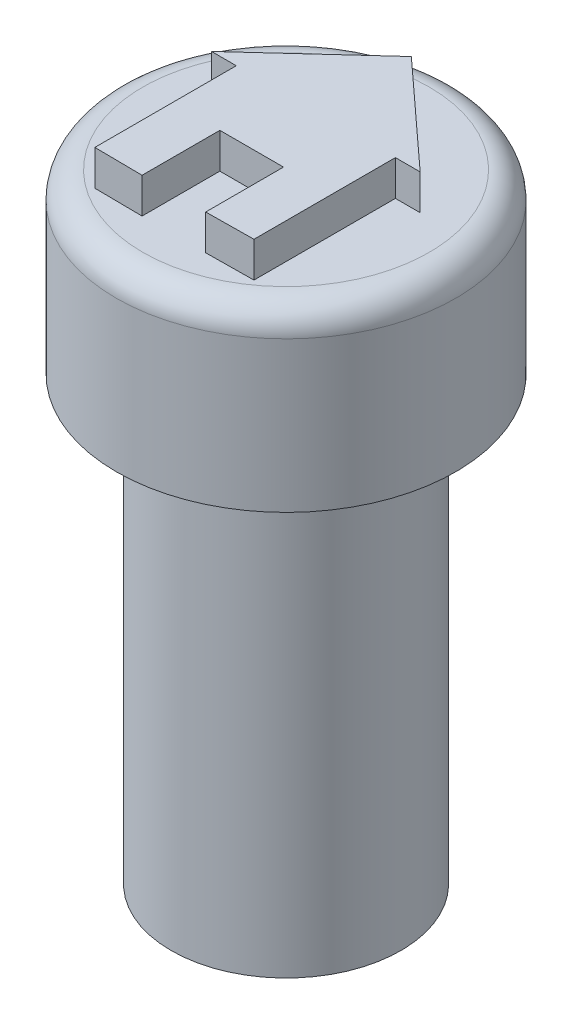
ISO-10303-21;
HEADER;
FILE_DESCRIPTION(('STEP AP214'),'2;1');
FILE_NAME('part.step','',(''),(''),'','','');
FILE_SCHEMA(('AUTOMOTIVE_DESIGN { 1 0 10303 214 1 1 1 1 }'));
ENDSEC;
DATA;
#1=APPLICATION_CONTEXT('core data for automotive mechanical design processes');
#2=APPLICATION_PROTOCOL_DEFINITION('international standard','automotive_design',2000,#1);
#3=PRODUCT_CONTEXT('',#1,'mechanical');
#4=PRODUCT('Part','Part','',(#3));
#5=PRODUCT_RELATED_PRODUCT_CATEGORY('part','',(#4));
#6=PRODUCT_DEFINITION_FORMATION('','',#4);
#7=PRODUCT_DEFINITION_CONTEXT('part definition',#1,'design');
#8=PRODUCT_DEFINITION('design','',#6,#7);
#9=PRODUCT_DEFINITION_SHAPE('','',#8);
#10=(LENGTH_UNIT() NAMED_UNIT(*) SI_UNIT(.MILLI.,.METRE.));
#11=(NAMED_UNIT(*) PLANE_ANGLE_UNIT() SI_UNIT($,.RADIAN.));
#12=(NAMED_UNIT(*) SI_UNIT($,.STERADIAN.) SOLID_ANGLE_UNIT());
#13=UNCERTAINTY_MEASURE_WITH_UNIT(LENGTH_MEASURE(1.E-05),#10,'distance_accuracy_value','');
#14=(GEOMETRIC_REPRESENTATION_CONTEXT(3) GLOBAL_UNCERTAINTY_ASSIGNED_CONTEXT((#13)) GLOBAL_UNIT_ASSIGNED_CONTEXT((#10,
#11,#12)) REPRESENTATION_CONTEXT('',''));
#15=CARTESIAN_POINT('',(0.,0.,0.));
#16=DIRECTION('',(0.,0.,1.));
#17=DIRECTION('',(1.,0.,0.));
#18=AXIS2_PLACEMENT_3D('',#15,#16,#17);
#19=CARTESIAN_POINT('',(0.,12.5,0.));
#20=DIRECTION('',(0.,-1.,0.));
#21=DIRECTION('',(0.,0.,-1.));
#22=AXIS2_PLACEMENT_3D('',#19,#20,#21);
#23=CYLINDRICAL_SURFACE('',#22,3.25);
#24=CARTESIAN_POINT('',(0.,12.5,0.));
#25=DIRECTION('',(0.,1.,0.));
#26=DIRECTION('',(0.,0.,1.));
#27=AXIS2_PLACEMENT_3D('',#24,#25,#26);
#28=CIRCLE('',#27,3.25);
#29=CARTESIAN_POINT('',(0.,12.5,3.25));
#30=VERTEX_POINT('',#29);
#31=EDGE_CURVE('E209',#30,#30,#28,.T.);
#32=ORIENTED_EDGE('',*,*,#31,.F.);
#33=EDGE_LOOP('',(#32));
#34=FACE_BOUND('',#33,.T.);
#35=CARTESIAN_POINT('',(0.,0.,0.));
#36=DIRECTION('',(0.,1.,0.));
#37=DIRECTION('',(0.,0.,1.));
#38=AXIS2_PLACEMENT_3D('',#35,#36,#37);
#39=CIRCLE('',#38,3.25);
#40=CARTESIAN_POINT('',(0.,0.,3.25));
#41=VERTEX_POINT('',#40);
#42=EDGE_CURVE('E205',#41,#41,#39,.T.);
#43=ORIENTED_EDGE('',*,*,#42,.T.);
#44=EDGE_LOOP('',(#43));
#45=FACE_BOUND('',#44,.T.);
#46=ADVANCED_FACE('F83',(#34,#45),#23,.T.);
#47=CARTESIAN_POINT('',(0.,0.,0.));
#48=DIRECTION('',(0.,1.,0.));
#49=DIRECTION('',(0.,0.,1.));
#50=AXIS2_PLACEMENT_3D('',#47,#48,#49);
#51=PLANE('',#50);
#52=CARTESIAN_POINT('',(0.,0.,0.));
#53=DIRECTION('',(0.,-1.,0.));
#54=DIRECTION('',(0.,0.,-1.));
#55=AXIS2_PLACEMENT_3D('',#52,#53,#54);
#56=CIRCLE('',#55,1.75);
#57=CARTESIAN_POINT('',(0.,0.,-1.75));
#58=VERTEX_POINT('',#57);
#59=EDGE_CURVE('E195',#58,#58,#56,.T.);
#60=ORIENTED_EDGE('',*,*,#59,.F.);
#61=EDGE_LOOP('',(#60));
#62=FACE_BOUND('',#61,.T.);
#63=ORIENTED_EDGE('',*,*,#42,.F.);
#64=EDGE_LOOP('',(#63));
#65=FACE_BOUND('',#64,.T.);
#66=ADVANCED_FACE('F231',(#62,#65),#51,.F.);
#67=CARTESIAN_POINT('',(0.,2.5,0.));
#68=DIRECTION('',(0.,-1.,0.));
#69=DIRECTION('',(0.,0.,-1.));
#70=AXIS2_PLACEMENT_3D('',#67,#68,#69);
#71=CYLINDRICAL_SURFACE('',#70,1.75);
#72=CARTESIAN_POINT('',(0.,2.5,0.));
#73=DIRECTION('',(0.,-1.,0.));
#74=DIRECTION('',(0.,0.,-1.));
#75=AXIS2_PLACEMENT_3D('',#72,#73,#74);
#76=CIRCLE('',#75,1.75);
#77=CARTESIAN_POINT('',(0.,2.5,-1.75));
#78=VERTEX_POINT('',#77);
#79=EDGE_CURVE('E201',#78,#78,#76,.T.);
#80=ORIENTED_EDGE('',*,*,#79,.F.);
#81=EDGE_LOOP('',(#80));
#82=FACE_BOUND('',#81,.T.);
#83=ORIENTED_EDGE('',*,*,#59,.T.);
#84=EDGE_LOOP('',(#83));
#85=FACE_BOUND('',#84,.T.);
#86=ADVANCED_FACE('F236',(#82,#85),#71,.F.);
#87=CARTESIAN_POINT('',(0.,2.5,0.));
#88=DIRECTION('',(0.,-1.,0.));
#89=DIRECTION('',(0.,0.,-1.));
#90=AXIS2_PLACEMENT_3D('',#87,#88,#89);
#91=PLANE('',#90);
#92=ORIENTED_EDGE('',*,*,#79,.T.);
#93=EDGE_LOOP('',(#92));
#94=FACE_BOUND('',#93,.T.);
#95=ADVANCED_FACE('F244',(#94),#91,.T.);
#96=CARTESIAN_POINT('',(0.,17.5,0.));
#97=DIRECTION('',(0.,-1.,0.));
#98=DIRECTION('',(0.,0.,-1.));
#99=AXIS2_PLACEMENT_3D('',#96,#97,#98);
#100=CYLINDRICAL_SURFACE('',#99,4.8);
#101=CARTESIAN_POINT('',(0.,16.75,0.));
#102=DIRECTION('',(0.,1.,0.));
#103=DIRECTION('',(0.,0.,1.));
#104=AXIS2_PLACEMENT_3D('',#101,#102,#103);
#105=CIRCLE('',#104,4.8);
#106=CARTESIAN_POINT('',(0.,16.75,4.8));
#107=VERTEX_POINT('',#106);
#108=EDGE_CURVE('E12',#107,#107,#105,.F.);
#109=ORIENTED_EDGE('',*,*,#108,.T.);
#110=EDGE_LOOP('',(#109));
#111=FACE_BOUND('',#110,.T.);
#112=CARTESIAN_POINT('',(0.,12.5,0.));
#113=DIRECTION('',(0.,1.,0.));
#114=DIRECTION('',(0.,0.,1.));
#115=AXIS2_PLACEMENT_3D('',#112,#113,#114);
#116=CIRCLE('',#115,4.8);
#117=CARTESIAN_POINT('',(0.,12.5,4.8));
#118=VERTEX_POINT('',#117);
#119=EDGE_CURVE('E190',#118,#118,#116,.T.);
#120=ORIENTED_EDGE('',*,*,#119,.T.);
#121=EDGE_LOOP('',(#120));
#122=FACE_BOUND('',#121,.T.);
#123=ADVANCED_FACE('F248',(#111,#122),#100,.T.);
#124=CARTESIAN_POINT('',(0.,17.5,0.));
#125=DIRECTION('',(0.,1.,0.));
#126=DIRECTION('',(0.,0.,1.));
#127=AXIS2_PLACEMENT_3D('',#124,#125,#126);
#128=PLANE('',#127);
#129=CARTESIAN_POINT('',(0.,17.5,0.));
#130=DIRECTION('',(0.,1.,0.));
#131=DIRECTION('',(0.,0.,1.));
#132=AXIS2_PLACEMENT_3D('',#129,#130,#131);
#133=CIRCLE('',#132,4.05);
#134=CARTESIAN_POINT('',(0.,17.5,4.05));
#135=VERTEX_POINT('',#134);
#136=EDGE_CURVE('E92',#135,#135,#133,.T.);
#137=ORIENTED_EDGE('',*,*,#136,.T.);
#138=EDGE_LOOP('',(#137));
#139=FACE_BOUND('',#138,.T.);
#140=DIRECTION('',(-0.737672912354375,0.,-0.675158258765021));
#141=VECTOR('',#140,1.);
#142=CARTESIAN_POINT('',(2.95,17.5,-0.842487973796764));
#143=LINE('',#142,#141);
#144=CARTESIAN_POINT('',(2.95,17.5,-0.842487973796764));
#145=VERTEX_POINT('',#144);
#146=CARTESIAN_POINT('',(0.,17.5,-3.54248797379676));
#147=VERTEX_POINT('',#146);
#148=EDGE_CURVE('E99',#145,#147,#143,.T.);
#149=ORIENTED_EDGE('',*,*,#148,.F.);
#150=DIRECTION('',(1.,0.,0.));
#151=VECTOR('',#150,1.);
#152=CARTESIAN_POINT('',(2.25,17.5,-0.842487973796764));
#153=LINE('',#152,#151);
#154=CARTESIAN_POINT('',(2.25,17.5,-0.842487973796764));
#155=VERTEX_POINT('',#154);
#156=EDGE_CURVE('E103',#155,#145,#153,.T.);
#157=ORIENTED_EDGE('',*,*,#156,.F.);
#158=DIRECTION('',(0.,0.,-1.));
#159=VECTOR('',#158,1.);
#160=CARTESIAN_POINT('',(2.25,17.5,3.15751202620324));
#161=LINE('',#160,#159);
#162=CARTESIAN_POINT('',(2.25,17.5,3.15751202620324));
#163=VERTEX_POINT('',#162);
#164=EDGE_CURVE('E303',#163,#155,#161,.T.);
#165=ORIENTED_EDGE('',*,*,#164,.F.);
#166=DIRECTION('',(0.99993946534493,0.,-0.0110029834906805));
#167=VECTOR('',#166,1.);
#168=CARTESIAN_POINT('',(0.9,17.5,3.17236695315353));
#169=LINE('',#168,#167);
#170=CARTESIAN_POINT('',(0.9,17.5,3.17236695315353));
#171=VERTEX_POINT('',#170);
#172=EDGE_CURVE('E372',#171,#163,#169,.T.);
#173=ORIENTED_EDGE('',*,*,#172,.F.);
#174=DIRECTION('',(0.,0.,1.));
#175=VECTOR('',#174,1.);
#176=CARTESIAN_POINT('',(0.9,17.5,0.972366953153534));
#177=LINE('',#176,#175);
#178=CARTESIAN_POINT('',(0.9,17.5,0.972366953153534));
#179=VERTEX_POINT('',#178);
#180=EDGE_CURVE('E368',#179,#171,#177,.T.);
#181=ORIENTED_EDGE('',*,*,#180,.F.);
#182=DIRECTION('',(1.,0.,0.));
#183=VECTOR('',#182,1.);
#184=CARTESIAN_POINT('',(-0.9,17.5,0.972366953153534));
#185=LINE('',#184,#183);
#186=CARTESIAN_POINT('',(-0.9,17.5,0.972366953153534));
#187=VERTEX_POINT('',#186);
#188=EDGE_CURVE('E364',#187,#179,#185,.T.);
#189=ORIENTED_EDGE('',*,*,#188,.F.);
#190=DIRECTION('',(0.,0.,-1.));
#191=VECTOR('',#190,1.);
#192=CARTESIAN_POINT('',(-0.9,17.5,3.17236695315353));
#193=LINE('',#192,#191);
#194=CARTESIAN_POINT('',(-0.9,17.5,3.17236695315353));
#195=VERTEX_POINT('',#194);
#196=EDGE_CURVE('E360',#195,#187,#193,.T.);
#197=ORIENTED_EDGE('',*,*,#196,.F.);
#198=DIRECTION('',(0.99993946534493,0.,0.0110029834906805));
#199=VECTOR('',#198,1.);
#200=CARTESIAN_POINT('',(-2.25,17.5,3.15751202620324));
#201=LINE('',#200,#199);
#202=CARTESIAN_POINT('',(-2.25,17.5,3.15751202620324));
#203=VERTEX_POINT('',#202);
#204=EDGE_CURVE('E352',#203,#195,#201,.T.);
#205=ORIENTED_EDGE('',*,*,#204,.F.);
#206=DIRECTION('',(0.,0.,1.));
#207=VECTOR('',#206,1.);
#208=CARTESIAN_POINT('',(-2.25,17.5,-0.842487973796764));
#209=LINE('',#208,#207);
#210=CARTESIAN_POINT('',(-2.25,17.5,-0.842487973796764));
#211=VERTEX_POINT('',#210);
#212=EDGE_CURVE('E343',#211,#203,#209,.T.);
#213=ORIENTED_EDGE('',*,*,#212,.F.);
#214=DIRECTION('',(1.,0.,0.));
#215=VECTOR('',#214,1.);
#216=CARTESIAN_POINT('',(-2.95,17.5,-0.842487973796764));
#217=LINE('',#216,#215);
#218=CARTESIAN_POINT('',(-2.95,17.5,-0.842487973796764));
#219=VERTEX_POINT('',#218);
#220=EDGE_CURVE('E346',#219,#211,#217,.T.);
#221=ORIENTED_EDGE('',*,*,#220,.F.);
#222=DIRECTION('',(-0.737672912354375,0.,0.675158258765021));
#223=VECTOR('',#222,1.);
#224=CARTESIAN_POINT('',(0.,17.5,-3.54248797379676));
#225=LINE('',#224,#223);
#226=EDGE_CURVE('E348',#147,#219,#225,.T.);
#227=ORIENTED_EDGE('',*,*,#226,.F.);
#228=EDGE_LOOP('',(#149,#157,#165,#173,#181,#189,#197,#205,#213,#221,#227));
#229=FACE_BOUND('',#228,.T.);
#230=ADVANCED_FACE('F219',(#139,#229),#128,.T.);
#231=CARTESIAN_POINT('',(0.,12.5,0.));
#232=DIRECTION('',(0.,1.,0.));
#233=DIRECTION('',(0.,0.,1.));
#234=AXIS2_PLACEMENT_3D('',#231,#232,#233);
#235=PLANE('',#234);
#236=ORIENTED_EDGE('',*,*,#31,.T.);
#237=EDGE_LOOP('',(#236));
#238=FACE_BOUND('',#237,.T.);
#239=ORIENTED_EDGE('',*,*,#119,.F.);
#240=EDGE_LOOP('',(#239));
#241=FACE_BOUND('',#240,.T.);
#242=ADVANCED_FACE('F253',(#238,#241),#235,.F.);
#243=CARTESIAN_POINT('',(2.95,18.5,-0.842487973796764));
#244=DIRECTION('',(-0.675158258765021,0.,0.737672912354375));
#245=DIRECTION('',(0.737672912354375,0.,0.675158258765021));
#246=AXIS2_PLACEMENT_3D('',#243,#244,#245);
#247=PLANE('',#246);
#248=ORIENTED_EDGE('',*,*,#148,.T.);
#249=DIRECTION('',(0.,-1.,0.));
#250=VECTOR('',#249,1.);
#251=CARTESIAN_POINT('',(0.,18.5,-3.54248797379676));
#252=LINE('',#251,#250);
#253=CARTESIAN_POINT('',(0.,18.5,-3.54248797379676));
#254=VERTEX_POINT('',#253);
#255=EDGE_CURVE('E170',#254,#147,#252,.T.);
#256=ORIENTED_EDGE('',*,*,#255,.F.);
#257=DIRECTION('',(-0.737672912354375,0.,-0.675158258765021));
#258=VECTOR('',#257,1.);
#259=CARTESIAN_POINT('',(2.95,18.5,-0.842487973796764));
#260=LINE('',#259,#258);
#261=CARTESIAN_POINT('',(2.95,18.5,-0.842487973796764));
#262=VERTEX_POINT('',#261);
#263=EDGE_CURVE('E177',#262,#254,#260,.T.);
#264=ORIENTED_EDGE('',*,*,#263,.F.);
#265=DIRECTION('',(0.,-1.,0.));
#266=VECTOR('',#265,1.);
#267=CARTESIAN_POINT('',(2.95,18.5,-0.842487973796764));
#268=LINE('',#267,#266);
#269=EDGE_CURVE('E299',#262,#145,#268,.T.);
#270=ORIENTED_EDGE('',*,*,#269,.T.);
#271=EDGE_LOOP('',(#248,#256,#264,#270));
#272=FACE_BOUND('',#271,.T.);
#273=ADVANCED_FACE('F188',(#272),#247,.F.);
#274=CARTESIAN_POINT('',(0.,18.5,-3.54248797379676));
#275=DIRECTION('',(0.675158258765021,0.,0.737672912354375));
#276=DIRECTION('',(0.737672912354375,0.,-0.675158258765021));
#277=AXIS2_PLACEMENT_3D('',#274,#275,#276);
#278=PLANE('',#277);
#279=ORIENTED_EDGE('',*,*,#226,.T.);
#280=DIRECTION('',(0.,-1.,0.));
#281=VECTOR('',#280,1.);
#282=CARTESIAN_POINT('',(-2.95,18.5,-0.842487973796764));
#283=LINE('',#282,#281);
#284=CARTESIAN_POINT('',(-2.95,18.5,-0.842487973796764));
#285=VERTEX_POINT('',#284);
#286=EDGE_CURVE('E172',#285,#219,#283,.T.);
#287=ORIENTED_EDGE('',*,*,#286,.F.);
#288=DIRECTION('',(-0.737672912354375,0.,0.675158258765021));
#289=VECTOR('',#288,1.);
#290=CARTESIAN_POINT('',(0.,18.5,-3.54248797379676));
#291=LINE('',#290,#289);
#292=EDGE_CURVE('E165',#254,#285,#291,.T.);
#293=ORIENTED_EDGE('',*,*,#292,.F.);
#294=ORIENTED_EDGE('',*,*,#255,.T.);
#295=EDGE_LOOP('',(#279,#287,#293,#294));
#296=FACE_BOUND('',#295,.T.);
#297=ADVANCED_FACE('F168',(#296),#278,.F.);
#298=CARTESIAN_POINT('',(-2.95,18.5,-0.842487973796764));
#299=DIRECTION('',(0.,0.,-1.));
#300=DIRECTION('',(-1.,0.,0.));
#301=AXIS2_PLACEMENT_3D('',#298,#299,#300);
#302=PLANE('',#301);
#303=ORIENTED_EDGE('',*,*,#220,.T.);
#304=DIRECTION('',(0.,-1.,0.));
#305=VECTOR('',#304,1.);
#306=CARTESIAN_POINT('',(-2.25,18.5,-0.842487973796764));
#307=LINE('',#306,#305);
#308=CARTESIAN_POINT('',(-2.25,18.5,-0.842487973796764));
#309=VERTEX_POINT('',#308);
#310=EDGE_CURVE('E197',#309,#211,#307,.T.);
#311=ORIENTED_EDGE('',*,*,#310,.F.);
#312=DIRECTION('',(1.,0.,0.));
#313=VECTOR('',#312,1.);
#314=CARTESIAN_POINT('',(-2.95,18.5,-0.842487973796764));
#315=LINE('',#314,#313);
#316=EDGE_CURVE('E176',#285,#309,#315,.T.);
#317=ORIENTED_EDGE('',*,*,#316,.F.);
#318=ORIENTED_EDGE('',*,*,#286,.T.);
#319=EDGE_LOOP('',(#303,#311,#317,#318));
#320=FACE_BOUND('',#319,.T.);
#321=ADVANCED_FACE('F262',(#320),#302,.F.);
#322=CARTESIAN_POINT('',(-2.25,18.5,-0.842487973796764));
#323=DIRECTION('',(1.,0.,0.));
#324=DIRECTION('',(0.,0.,-1.));
#325=AXIS2_PLACEMENT_3D('',#322,#323,#324);
#326=PLANE('',#325);
#327=ORIENTED_EDGE('',*,*,#212,.T.);
#328=DIRECTION('',(0.,-1.,0.));
#329=VECTOR('',#328,1.);
#330=CARTESIAN_POINT('',(-2.25,18.5,3.15751202620324));
#331=LINE('',#330,#329);
#332=CARTESIAN_POINT('',(-2.25,18.5,3.15751202620324));
#333=VERTEX_POINT('',#332);
#334=EDGE_CURVE('E334',#333,#203,#331,.T.);
#335=ORIENTED_EDGE('',*,*,#334,.F.);
#336=DIRECTION('',(0.,0.,1.));
#337=VECTOR('',#336,1.);
#338=CARTESIAN_POINT('',(-2.25,18.5,-0.842487973796764));
#339=LINE('',#338,#337);
#340=EDGE_CURVE('E344',#309,#333,#339,.T.);
#341=ORIENTED_EDGE('',*,*,#340,.F.);
#342=ORIENTED_EDGE('',*,*,#310,.T.);
#343=EDGE_LOOP('',(#327,#335,#341,#342));
#344=FACE_BOUND('',#343,.T.);
#345=ADVANCED_FACE('F265',(#344),#326,.F.);
#346=CARTESIAN_POINT('',(-2.25,18.5,3.15751202620324));
#347=DIRECTION('',(0.0110029834906805,0.,-0.99993946534493));
#348=DIRECTION('',(-0.99993946534493,0.,-0.0110029834906805));
#349=AXIS2_PLACEMENT_3D('',#346,#347,#348);
#350=PLANE('',#349);
#351=ORIENTED_EDGE('',*,*,#204,.T.);
#352=DIRECTION('',(0.,-1.,0.));
#353=VECTOR('',#352,1.);
#354=CARTESIAN_POINT('',(-0.9,18.5,3.17236695315353));
#355=LINE('',#354,#353);
#356=CARTESIAN_POINT('',(-0.9,18.5,3.17236695315353));
#357=VERTEX_POINT('',#356);
#358=EDGE_CURVE('E330',#357,#195,#355,.T.);
#359=ORIENTED_EDGE('',*,*,#358,.F.);
#360=DIRECTION('',(0.99993946534493,0.,0.0110029834906805));
#361=VECTOR('',#360,1.);
#362=CARTESIAN_POINT('',(-2.25,18.5,3.15751202620324));
#363=LINE('',#362,#361);
#364=EDGE_CURVE('E391',#333,#357,#363,.T.);
#365=ORIENTED_EDGE('',*,*,#364,.F.);
#366=ORIENTED_EDGE('',*,*,#334,.T.);
#367=EDGE_LOOP('',(#351,#359,#365,#366));
#368=FACE_BOUND('',#367,.T.);
#369=ADVANCED_FACE('F269',(#368),#350,.F.);
#370=CARTESIAN_POINT('',(-0.9,18.5,3.17236695315353));
#371=DIRECTION('',(-1.,0.,0.));
#372=DIRECTION('',(0.,0.,1.));
#373=AXIS2_PLACEMENT_3D('',#370,#371,#372);
#374=PLANE('',#373);
#375=ORIENTED_EDGE('',*,*,#196,.T.);
#376=DIRECTION('',(0.,-1.,0.));
#377=VECTOR('',#376,1.);
#378=CARTESIAN_POINT('',(-0.9,18.5,0.972366953153534));
#379=LINE('',#378,#377);
#380=CARTESIAN_POINT('',(-0.9,18.5,0.972366953153534));
#381=VERTEX_POINT('',#380);
#382=EDGE_CURVE('E326',#381,#187,#379,.T.);
#383=ORIENTED_EDGE('',*,*,#382,.F.);
#384=DIRECTION('',(0.,0.,-1.));
#385=VECTOR('',#384,1.);
#386=CARTESIAN_POINT('',(-0.9,18.5,3.17236695315353));
#387=LINE('',#386,#385);
#388=EDGE_CURVE('E388',#357,#381,#387,.T.);
#389=ORIENTED_EDGE('',*,*,#388,.F.);
#390=ORIENTED_EDGE('',*,*,#358,.T.);
#391=EDGE_LOOP('',(#375,#383,#389,#390));
#392=FACE_BOUND('',#391,.T.);
#393=ADVANCED_FACE('F273',(#392),#374,.F.);
#394=CARTESIAN_POINT('',(-0.9,18.5,0.972366953153534));
#395=DIRECTION('',(0.,0.,-1.));
#396=DIRECTION('',(-1.,0.,0.));
#397=AXIS2_PLACEMENT_3D('',#394,#395,#396);
#398=PLANE('',#397);
#399=ORIENTED_EDGE('',*,*,#188,.T.);
#400=DIRECTION('',(0.,-1.,0.));
#401=VECTOR('',#400,1.);
#402=CARTESIAN_POINT('',(0.9,18.5,0.972366953153534));
#403=LINE('',#402,#401);
#404=CARTESIAN_POINT('',(0.9,18.5,0.972366953153534));
#405=VERTEX_POINT('',#404);
#406=EDGE_CURVE('E322',#405,#179,#403,.T.);
#407=ORIENTED_EDGE('',*,*,#406,.F.);
#408=DIRECTION('',(1.,0.,0.));
#409=VECTOR('',#408,1.);
#410=CARTESIAN_POINT('',(-0.9,18.5,0.972366953153534));
#411=LINE('',#410,#409);
#412=EDGE_CURVE('E386',#381,#405,#411,.T.);
#413=ORIENTED_EDGE('',*,*,#412,.F.);
#414=ORIENTED_EDGE('',*,*,#382,.T.);
#415=EDGE_LOOP('',(#399,#407,#413,#414));
#416=FACE_BOUND('',#415,.T.);
#417=ADVANCED_FACE('F277',(#416),#398,.F.);
#418=CARTESIAN_POINT('',(0.9,18.5,0.972366953153534));
#419=DIRECTION('',(1.,0.,0.));
#420=DIRECTION('',(0.,0.,-1.));
#421=AXIS2_PLACEMENT_3D('',#418,#419,#420);
#422=PLANE('',#421);
#423=ORIENTED_EDGE('',*,*,#180,.T.);
#424=DIRECTION('',(0.,-1.,0.));
#425=VECTOR('',#424,1.);
#426=CARTESIAN_POINT('',(0.9,18.5,3.17236695315353));
#427=LINE('',#426,#425);
#428=CARTESIAN_POINT('',(0.9,18.5,3.17236695315353));
#429=VERTEX_POINT('',#428);
#430=EDGE_CURVE('E318',#429,#171,#427,.T.);
#431=ORIENTED_EDGE('',*,*,#430,.F.);
#432=DIRECTION('',(0.,0.,1.));
#433=VECTOR('',#432,1.);
#434=CARTESIAN_POINT('',(0.9,18.5,0.972366953153534));
#435=LINE('',#434,#433);
#436=EDGE_CURVE('E382',#405,#429,#435,.T.);
#437=ORIENTED_EDGE('',*,*,#436,.F.);
#438=ORIENTED_EDGE('',*,*,#406,.T.);
#439=EDGE_LOOP('',(#423,#431,#437,#438));
#440=FACE_BOUND('',#439,.T.);
#441=ADVANCED_FACE('F281',(#440),#422,.F.);
#442=CARTESIAN_POINT('',(0.9,18.5,3.17236695315353));
#443=DIRECTION('',(-0.0110029834906805,0.,-0.99993946534493));
#444=DIRECTION('',(-0.99993946534493,0.,0.0110029834906805));
#445=AXIS2_PLACEMENT_3D('',#442,#443,#444);
#446=PLANE('',#445);
#447=ORIENTED_EDGE('',*,*,#172,.T.);
#448=DIRECTION('',(0.,-1.,0.));
#449=VECTOR('',#448,1.);
#450=CARTESIAN_POINT('',(2.25,18.5,3.15751202620324));
#451=LINE('',#450,#449);
#452=CARTESIAN_POINT('',(2.25,18.5,3.15751202620324));
#453=VERTEX_POINT('',#452);
#454=EDGE_CURVE('E309',#453,#163,#451,.T.);
#455=ORIENTED_EDGE('',*,*,#454,.F.);
#456=DIRECTION('',(0.99993946534493,0.,-0.0110029834906805));
#457=VECTOR('',#456,1.);
#458=CARTESIAN_POINT('',(0.9,18.5,3.17236695315353));
#459=LINE('',#458,#457);
#460=EDGE_CURVE('E380',#429,#453,#459,.T.);
#461=ORIENTED_EDGE('',*,*,#460,.F.);
#462=ORIENTED_EDGE('',*,*,#430,.T.);
#463=EDGE_LOOP('',(#447,#455,#461,#462));
#464=FACE_BOUND('',#463,.T.);
#465=ADVANCED_FACE('F285',(#464),#446,.F.);
#466=CARTESIAN_POINT('',(2.25,18.5,3.15751202620324));
#467=DIRECTION('',(-1.,0.,0.));
#468=DIRECTION('',(0.,0.,1.));
#469=AXIS2_PLACEMENT_3D('',#466,#467,#468);
#470=PLANE('',#469);
#471=ORIENTED_EDGE('',*,*,#164,.T.);
#472=DIRECTION('',(0.,-1.,0.));
#473=VECTOR('',#472,1.);
#474=CARTESIAN_POINT('',(2.25,18.5,-0.842487973796764));
#475=LINE('',#474,#473);
#476=CARTESIAN_POINT('',(2.25,18.5,-0.842487973796764));
#477=VERTEX_POINT('',#476);
#478=EDGE_CURVE('E301',#477,#155,#475,.T.);
#479=ORIENTED_EDGE('',*,*,#478,.F.);
#480=DIRECTION('',(0.,0.,-1.));
#481=VECTOR('',#480,1.);
#482=CARTESIAN_POINT('',(2.25,18.5,3.15751202620324));
#483=LINE('',#482,#481);
#484=EDGE_CURVE('E311',#453,#477,#483,.T.);
#485=ORIENTED_EDGE('',*,*,#484,.F.);
#486=ORIENTED_EDGE('',*,*,#454,.T.);
#487=EDGE_LOOP('',(#471,#479,#485,#486));
#488=FACE_BOUND('',#487,.T.);
#489=ADVANCED_FACE('F289',(#488),#470,.F.);
#490=CARTESIAN_POINT('',(2.25,18.5,-0.842487973796764));
#491=DIRECTION('',(0.,0.,-1.));
#492=DIRECTION('',(-1.,0.,0.));
#493=AXIS2_PLACEMENT_3D('',#490,#491,#492);
#494=PLANE('',#493);
#495=ORIENTED_EDGE('',*,*,#156,.T.);
#496=ORIENTED_EDGE('',*,*,#269,.F.);
#497=DIRECTION('',(1.,0.,0.));
#498=VECTOR('',#497,1.);
#499=CARTESIAN_POINT('',(2.25,18.5,-0.842487973796764));
#500=LINE('',#499,#498);
#501=EDGE_CURVE('E182',#477,#262,#500,.T.);
#502=ORIENTED_EDGE('',*,*,#501,.F.);
#503=ORIENTED_EDGE('',*,*,#478,.T.);
#504=EDGE_LOOP('',(#495,#496,#502,#503));
#505=FACE_BOUND('',#504,.T.);
#506=ADVANCED_FACE('F227',(#505),#494,.F.);
#507=CARTESIAN_POINT('',(0.,18.5,0.));
#508=DIRECTION('',(0.,1.,0.));
#509=DIRECTION('',(0.,0.,1.));
#510=AXIS2_PLACEMENT_3D('',#507,#508,#509);
#511=PLANE('',#510);
#512=ORIENTED_EDGE('',*,*,#263,.T.);
#513=ORIENTED_EDGE('',*,*,#292,.T.);
#514=ORIENTED_EDGE('',*,*,#316,.T.);
#515=ORIENTED_EDGE('',*,*,#340,.T.);
#516=ORIENTED_EDGE('',*,*,#364,.T.);
#517=ORIENTED_EDGE('',*,*,#388,.T.);
#518=ORIENTED_EDGE('',*,*,#412,.T.);
#519=ORIENTED_EDGE('',*,*,#436,.T.);
#520=ORIENTED_EDGE('',*,*,#460,.T.);
#521=ORIENTED_EDGE('',*,*,#484,.T.);
#522=ORIENTED_EDGE('',*,*,#501,.T.);
#523=EDGE_LOOP('',(#512,#513,#514,#515,#516,#517,#518,#519,#520,#521,#522));
#524=FACE_BOUND('',#523,.T.);
#525=ADVANCED_FACE('F180',(#524),#511,.T.);
#526=CARTESIAN_POINT('',(0.,16.75,0.));
#527=DIRECTION('',(0.,1.,0.));
#528=DIRECTION('',(0.,0.,1.));
#529=AXIS2_PLACEMENT_3D('',#526,#527,#528);
#530=TOROIDAL_SURFACE('',#529,4.05,0.75);
#531=ORIENTED_EDGE('',*,*,#108,.F.);
#532=EDGE_LOOP('',(#531));
#533=FACE_BOUND('',#532,.T.);
#534=ORIENTED_EDGE('',*,*,#136,.F.);
#535=EDGE_LOOP('',(#534));
#536=FACE_BOUND('',#535,.T.);
#537=ADVANCED_FACE('F85',(#533,#536),#530,.T.);
#538=CLOSED_SHELL('',(#46,#66,#86,#95,#123,#230,#242,#273,#297,#321,#345,#369,#393,#417,#441,
#465,#489,#506,#525,#537));
#539=MANIFOLD_SOLID_BREP('B2',#538);
#540=ADVANCED_BREP_SHAPE_REPRESENTATION('',(#18,#539),#14);
#541=SHAPE_DEFINITION_REPRESENTATION(#9,#540);
ENDSEC;
END-ISO-10303-21;
